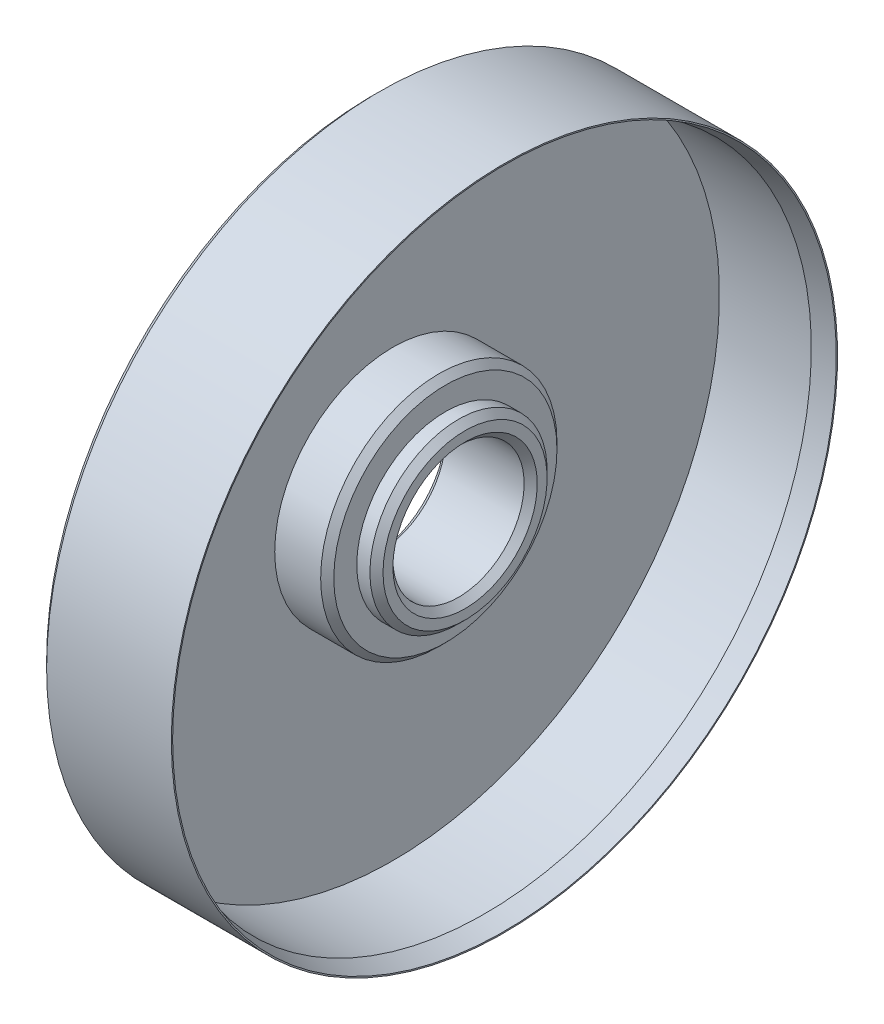
ISO-10303-21;
HEADER;
FILE_DESCRIPTION(('STEP AP214'),'2;1');
FILE_NAME('part.step','',(''),(''),'','','');
FILE_SCHEMA(('AUTOMOTIVE_DESIGN { 1 0 10303 214 1 1 1 1 }'));
ENDSEC;
DATA;
#1=APPLICATION_CONTEXT('core data for automotive mechanical design processes');
#2=APPLICATION_PROTOCOL_DEFINITION('international standard','automotive_design',2000,#1);
#3=PRODUCT_CONTEXT('',#1,'mechanical');
#4=PRODUCT('Part','Part','',(#3));
#5=PRODUCT_RELATED_PRODUCT_CATEGORY('part','',(#4));
#6=PRODUCT_DEFINITION_FORMATION('','',#4);
#7=PRODUCT_DEFINITION_CONTEXT('part definition',#1,'design');
#8=PRODUCT_DEFINITION('design','',#6,#7);
#9=PRODUCT_DEFINITION_SHAPE('','',#8);
#10=(LENGTH_UNIT() NAMED_UNIT(*) SI_UNIT(.MILLI.,.METRE.));
#11=(NAMED_UNIT(*) PLANE_ANGLE_UNIT() SI_UNIT($,.RADIAN.));
#12=(NAMED_UNIT(*) SI_UNIT($,.STERADIAN.) SOLID_ANGLE_UNIT());
#13=UNCERTAINTY_MEASURE_WITH_UNIT(LENGTH_MEASURE(1.E-05),#10,'distance_accuracy_value','');
#14=(GEOMETRIC_REPRESENTATION_CONTEXT(3) GLOBAL_UNCERTAINTY_ASSIGNED_CONTEXT((#13)) GLOBAL_UNIT_ASSIGNED_CONTEXT((#10,
#11,#12)) REPRESENTATION_CONTEXT('',''));
#15=CARTESIAN_POINT('',(0.,0.,0.));
#16=DIRECTION('',(0.,0.,1.));
#17=DIRECTION('',(1.,0.,0.));
#18=AXIS2_PLACEMENT_3D('',#15,#16,#17);
#19=CARTESIAN_POINT('',(0.,0.,0.));
#20=DIRECTION('',(-1.,0.,0.));
#21=DIRECTION('',(0.,0.,1.));
#22=AXIS2_PLACEMENT_3D('',#19,#20,#21);
#23=CYLINDRICAL_SURFACE('',#22,18.);
#24=CARTESIAN_POINT('',(3.,0.,0.));
#25=DIRECTION('',(-1.,0.,0.));
#26=DIRECTION('',(0.,0.,1.));
#27=AXIS2_PLACEMENT_3D('',#24,#25,#26);
#28=CIRCLE('',#27,18.);
#29=CARTESIAN_POINT('',(3.,0.,18.));
#30=VERTEX_POINT('',#29);
#31=EDGE_CURVE('E110',#30,#30,#28,.T.);
#32=ORIENTED_EDGE('',*,*,#31,.F.);
#33=EDGE_LOOP('',(#32));
#34=FACE_BOUND('',#33,.T.);
#35=CARTESIAN_POINT('',(10.,0.,0.));
#36=DIRECTION('',(-1.,0.,0.));
#37=DIRECTION('',(0.,0.,1.));
#38=AXIS2_PLACEMENT_3D('',#35,#36,#37);
#39=CIRCLE('',#38,18.);
#40=CARTESIAN_POINT('',(10.,0.,18.));
#41=VERTEX_POINT('',#40);
#42=EDGE_CURVE('E10',#41,#41,#39,.T.);
#43=ORIENTED_EDGE('',*,*,#42,.T.);
#44=EDGE_LOOP('',(#43));
#45=FACE_BOUND('',#44,.T.);
#46=ADVANCED_FACE('F43',(#34,#45),#23,.T.);
#47=CARTESIAN_POINT('',(11.,0.,0.));
#48=DIRECTION('',(-1.,0.,0.));
#49=DIRECTION('',(0.,0.,1.));
#50=AXIS2_PLACEMENT_3D('',#47,#48,#49);
#51=CONICAL_SURFACE('',#50,17.,0.785398163397449);
#52=ORIENTED_EDGE('',*,*,#42,.F.);
#53=EDGE_LOOP('',(#52));
#54=FACE_BOUND('',#53,.T.);
#55=CARTESIAN_POINT('',(11.,0.,0.));
#56=DIRECTION('',(-1.,0.,0.));
#57=DIRECTION('',(0.,0.,1.));
#58=AXIS2_PLACEMENT_3D('',#55,#56,#57);
#59=CIRCLE('',#58,17.);
#60=CARTESIAN_POINT('',(11.,0.,17.));
#61=VERTEX_POINT('',#60);
#62=EDGE_CURVE('E50',#61,#61,#59,.T.);
#63=ORIENTED_EDGE('',*,*,#62,.T.);
#64=EDGE_LOOP('',(#63));
#65=FACE_BOUND('',#64,.T.);
#66=ADVANCED_FACE('F118',(#54,#65),#51,.T.);
#67=CARTESIAN_POINT('',(11.,17.,0.));
#68=DIRECTION('',(-1.,0.,0.));
#69=DIRECTION('',(0.,0.,1.));
#70=AXIS2_PLACEMENT_3D('',#67,#68,#69);
#71=PLANE('',#70);
#72=ORIENTED_EDGE('',*,*,#62,.F.);
#73=EDGE_LOOP('',(#72));
#74=FACE_BOUND('',#73,.T.);
#75=CARTESIAN_POINT('',(11.,0.,0.));
#76=DIRECTION('',(-1.,0.,0.));
#77=DIRECTION('',(0.,0.,1.));
#78=AXIS2_PLACEMENT_3D('',#75,#76,#77);
#79=CIRCLE('',#78,13.5);
#80=CARTESIAN_POINT('',(11.,0.,13.5));
#81=VERTEX_POINT('',#80);
#82=EDGE_CURVE('E55',#81,#81,#79,.T.);
#83=ORIENTED_EDGE('',*,*,#82,.T.);
#84=EDGE_LOOP('',(#83));
#85=FACE_BOUND('',#84,.T.);
#86=ADVANCED_FACE('F122',(#74,#85),#71,.F.);
#87=CARTESIAN_POINT('',(0.,0.,0.));
#88=DIRECTION('',(-1.,0.,0.));
#89=DIRECTION('',(0.,0.,1.));
#90=AXIS2_PLACEMENT_3D('',#87,#88,#89);
#91=CYLINDRICAL_SURFACE('',#90,13.5);
#92=ORIENTED_EDGE('',*,*,#82,.F.);
#93=EDGE_LOOP('',(#92));
#94=FACE_BOUND('',#93,.T.);
#95=CARTESIAN_POINT('',(13.,0.,0.));
#96=DIRECTION('',(-1.,0.,0.));
#97=DIRECTION('',(0.,0.,1.));
#98=AXIS2_PLACEMENT_3D('',#95,#96,#97);
#99=CIRCLE('',#98,13.5);
#100=CARTESIAN_POINT('',(13.,0.,13.5));
#101=VERTEX_POINT('',#100);
#102=EDGE_CURVE('E60',#101,#101,#99,.T.);
#103=ORIENTED_EDGE('',*,*,#102,.T.);
#104=EDGE_LOOP('',(#103));
#105=FACE_BOUND('',#104,.T.);
#106=ADVANCED_FACE('F127',(#94,#105),#91,.T.);
#107=CARTESIAN_POINT('',(14.,0.,0.));
#108=DIRECTION('',(-1.,0.,0.));
#109=DIRECTION('',(0.,0.,1.));
#110=AXIS2_PLACEMENT_3D('',#107,#108,#109);
#111=CONICAL_SURFACE('',#110,12.5,0.785398163397448);
#112=ORIENTED_EDGE('',*,*,#102,.F.);
#113=EDGE_LOOP('',(#112));
#114=FACE_BOUND('',#113,.T.);
#115=CARTESIAN_POINT('',(14.,0.,0.));
#116=DIRECTION('',(-1.,0.,0.));
#117=DIRECTION('',(0.,0.,1.));
#118=AXIS2_PLACEMENT_3D('',#115,#116,#117);
#119=CIRCLE('',#118,12.5);
#120=CARTESIAN_POINT('',(14.,0.,12.5));
#121=VERTEX_POINT('',#120);
#122=EDGE_CURVE('E66',#121,#121,#119,.T.);
#123=ORIENTED_EDGE('',*,*,#122,.T.);
#124=EDGE_LOOP('',(#123));
#125=FACE_BOUND('',#124,.T.);
#126=ADVANCED_FACE('F133',(#114,#125),#111,.T.);
#127=CARTESIAN_POINT('',(14.,12.5,0.));
#128=DIRECTION('',(-1.,0.,0.));
#129=DIRECTION('',(0.,0.,1.));
#130=AXIS2_PLACEMENT_3D('',#127,#128,#129);
#131=PLANE('',#130);
#132=ORIENTED_EDGE('',*,*,#122,.F.);
#133=EDGE_LOOP('',(#132));
#134=FACE_BOUND('',#133,.T.);
#135=CARTESIAN_POINT('',(14.,0.,0.));
#136=DIRECTION('',(-1.,0.,0.));
#137=DIRECTION('',(0.,0.,1.));
#138=AXIS2_PLACEMENT_3D('',#135,#136,#137);
#139=CIRCLE('',#138,11.);
#140=CARTESIAN_POINT('',(14.,0.,11.));
#141=VERTEX_POINT('',#140);
#142=EDGE_CURVE('E70',#141,#141,#139,.T.);
#143=ORIENTED_EDGE('',*,*,#142,.T.);
#144=EDGE_LOOP('',(#143));
#145=FACE_BOUND('',#144,.T.);
#146=ADVANCED_FACE('F137',(#134,#145),#131,.F.);
#147=CARTESIAN_POINT('',(13.,0.,0.));
#148=DIRECTION('',(1.,0.,0.));
#149=DIRECTION('',(0.,0.,-1.));
#150=AXIS2_PLACEMENT_3D('',#147,#148,#149);
#151=CONICAL_SURFACE('',#150,10.,0.785398163397449);
#152=ORIENTED_EDGE('',*,*,#142,.F.);
#153=EDGE_LOOP('',(#152));
#154=FACE_BOUND('',#153,.T.);
#155=CARTESIAN_POINT('',(13.,0.,0.));
#156=DIRECTION('',(-1.,0.,0.));
#157=DIRECTION('',(0.,0.,1.));
#158=AXIS2_PLACEMENT_3D('',#155,#156,#157);
#159=CIRCLE('',#158,10.);
#160=CARTESIAN_POINT('',(13.,0.,10.));
#161=VERTEX_POINT('',#160);
#162=EDGE_CURVE('E74',#161,#161,#159,.T.);
#163=ORIENTED_EDGE('',*,*,#162,.T.);
#164=EDGE_LOOP('',(#163));
#165=FACE_BOUND('',#164,.T.);
#166=ADVANCED_FACE('F141',(#154,#165),#151,.F.);
#167=CARTESIAN_POINT('',(0.,0.,0.));
#168=DIRECTION('',(-1.,0.,0.));
#169=DIRECTION('',(0.,0.,1.));
#170=AXIS2_PLACEMENT_3D('',#167,#168,#169);
#171=CYLINDRICAL_SURFACE('',#170,10.);
#172=ORIENTED_EDGE('',*,*,#162,.F.);
#173=EDGE_LOOP('',(#172));
#174=FACE_BOUND('',#173,.T.);
#175=CARTESIAN_POINT('',(1.,0.,0.));
#176=DIRECTION('',(-1.,0.,0.));
#177=DIRECTION('',(0.,0.,1.));
#178=AXIS2_PLACEMENT_3D('',#175,#176,#177);
#179=CIRCLE('',#178,10.);
#180=CARTESIAN_POINT('',(1.,0.,10.));
#181=VERTEX_POINT('',#180);
#182=EDGE_CURVE('E78',#181,#181,#179,.T.);
#183=ORIENTED_EDGE('',*,*,#182,.T.);
#184=EDGE_LOOP('',(#183));
#185=FACE_BOUND('',#184,.T.);
#186=ADVANCED_FACE('F145',(#174,#185),#171,.F.);
#187=CARTESIAN_POINT('',(0.,0.,0.));
#188=DIRECTION('',(-1.,0.,0.));
#189=DIRECTION('',(0.,0.,1.));
#190=AXIS2_PLACEMENT_3D('',#187,#188,#189);
#191=CONICAL_SURFACE('',#190,11.,0.785398163397448);
#192=ORIENTED_EDGE('',*,*,#182,.F.);
#193=EDGE_LOOP('',(#192));
#194=FACE_BOUND('',#193,.T.);
#195=CARTESIAN_POINT('',(0.,0.,0.));
#196=DIRECTION('',(-1.,0.,0.));
#197=DIRECTION('',(0.,0.,1.));
#198=AXIS2_PLACEMENT_3D('',#195,#196,#197);
#199=CIRCLE('',#198,11.);
#200=CARTESIAN_POINT('',(0.,0.,11.));
#201=VERTEX_POINT('',#200);
#202=EDGE_CURVE('E82',#201,#201,#199,.T.);
#203=ORIENTED_EDGE('',*,*,#202,.T.);
#204=EDGE_LOOP('',(#203));
#205=FACE_BOUND('',#204,.T.);
#206=ADVANCED_FACE('F149',(#194,#205),#191,.F.);
#207=CARTESIAN_POINT('',(0.,11.,0.));
#208=DIRECTION('',(1.,0.,0.));
#209=DIRECTION('',(0.,0.,-1.));
#210=AXIS2_PLACEMENT_3D('',#207,#208,#209);
#211=PLANE('',#210);
#212=ORIENTED_EDGE('',*,*,#202,.F.);
#213=EDGE_LOOP('',(#212));
#214=FACE_BOUND('',#213,.T.);
#215=CARTESIAN_POINT('',(0.,0.,0.));
#216=DIRECTION('',(-1.,0.,0.));
#217=DIRECTION('',(0.,0.,1.));
#218=AXIS2_PLACEMENT_3D('',#215,#216,#217);
#219=CIRCLE('',#218,49.75);
#220=CARTESIAN_POINT('',(0.,0.,49.75));
#221=VERTEX_POINT('',#220);
#222=EDGE_CURVE('E86',#221,#221,#219,.T.);
#223=ORIENTED_EDGE('',*,*,#222,.T.);
#224=EDGE_LOOP('',(#223));
#225=FACE_BOUND('',#224,.T.);
#226=ADVANCED_FACE('F153',(#214,#225),#211,.F.);
#227=CARTESIAN_POINT('',(1.,0.,0.));
#228=DIRECTION('',(1.,0.,0.));
#229=DIRECTION('',(0.,0.,-1.));
#230=AXIS2_PLACEMENT_3D('',#227,#228,#229);
#231=CONICAL_SURFACE('',#230,50.75,0.785398163397449);
#232=ORIENTED_EDGE('',*,*,#222,.F.);
#233=EDGE_LOOP('',(#232));
#234=FACE_BOUND('',#233,.T.);
#235=CARTESIAN_POINT('',(1.,0.,0.));
#236=DIRECTION('',(-1.,0.,0.));
#237=DIRECTION('',(0.,0.,1.));
#238=AXIS2_PLACEMENT_3D('',#235,#236,#237);
#239=CIRCLE('',#238,50.75);
#240=CARTESIAN_POINT('',(1.,0.,50.75));
#241=VERTEX_POINT('',#240);
#242=EDGE_CURVE('E90',#241,#241,#239,.T.);
#243=ORIENTED_EDGE('',*,*,#242,.T.);
#244=EDGE_LOOP('',(#243));
#245=FACE_BOUND('',#244,.T.);
#246=ADVANCED_FACE('F157',(#234,#245),#231,.T.);
#247=CARTESIAN_POINT('',(0.,0.,0.));
#248=DIRECTION('',(-1.,0.,0.));
#249=DIRECTION('',(0.,0.,1.));
#250=AXIS2_PLACEMENT_3D('',#247,#248,#249);
#251=CYLINDRICAL_SURFACE('',#250,50.75);
#252=ORIENTED_EDGE('',*,*,#242,.F.);
#253=EDGE_LOOP('',(#252));
#254=FACE_BOUND('',#253,.T.);
#255=CARTESIAN_POINT('',(20.,0.,0.));
#256=DIRECTION('',(-1.,0.,0.));
#257=DIRECTION('',(0.,0.,1.));
#258=AXIS2_PLACEMENT_3D('',#255,#256,#257);
#259=CIRCLE('',#258,50.75);
#260=CARTESIAN_POINT('',(20.,0.,50.75));
#261=VERTEX_POINT('',#260);
#262=EDGE_CURVE('E94',#261,#261,#259,.T.);
#263=ORIENTED_EDGE('',*,*,#262,.T.);
#264=EDGE_LOOP('',(#263));
#265=FACE_BOUND('',#264,.T.);
#266=ADVANCED_FACE('F161',(#254,#265),#251,.T.);
#267=CARTESIAN_POINT('',(20.,50.75,0.));
#268=DIRECTION('',(-1.,0.,0.));
#269=DIRECTION('',(0.,0.,1.));
#270=AXIS2_PLACEMENT_3D('',#267,#268,#269);
#271=PLANE('',#270);
#272=ORIENTED_EDGE('',*,*,#262,.F.);
#273=EDGE_LOOP('',(#272));
#274=FACE_BOUND('',#273,.T.);
#275=CARTESIAN_POINT('',(20.,0.,0.));
#276=DIRECTION('',(-1.,0.,0.));
#277=DIRECTION('',(0.,0.,1.));
#278=AXIS2_PLACEMENT_3D('',#275,#276,#277);
#279=CIRCLE('',#278,50.5538475772934);
#280=CARTESIAN_POINT('',(20.,0.,50.5538475772934));
#281=VERTEX_POINT('',#280);
#282=EDGE_CURVE('E98',#281,#281,#279,.T.);
#283=ORIENTED_EDGE('',*,*,#282,.T.);
#284=EDGE_LOOP('',(#283));
#285=FACE_BOUND('',#284,.T.);
#286=ADVANCED_FACE('F165',(#274,#285),#271,.F.);
#287=CARTESIAN_POINT('',(17.,0.,0.));
#288=DIRECTION('',(1.,0.,0.));
#289=DIRECTION('',(0.,0.,-1.));
#290=AXIS2_PLACEMENT_3D('',#287,#288,#289);
#291=CONICAL_SURFACE('',#290,49.75,0.261799387799143);
#292=ORIENTED_EDGE('',*,*,#282,.F.);
#293=EDGE_LOOP('',(#292));
#294=FACE_BOUND('',#293,.T.);
#295=CARTESIAN_POINT('',(17.,0.,0.));
#296=DIRECTION('',(-1.,0.,0.));
#297=DIRECTION('',(0.,0.,1.));
#298=AXIS2_PLACEMENT_3D('',#295,#296,#297);
#299=CIRCLE('',#298,49.75);
#300=CARTESIAN_POINT('',(17.,0.,49.75));
#301=VERTEX_POINT('',#300);
#302=EDGE_CURVE('E102',#301,#301,#299,.T.);
#303=ORIENTED_EDGE('',*,*,#302,.T.);
#304=EDGE_LOOP('',(#303));
#305=FACE_BOUND('',#304,.T.);
#306=ADVANCED_FACE('F169',(#294,#305),#291,.F.);
#307=CARTESIAN_POINT('',(0.,0.,0.));
#308=DIRECTION('',(-1.,0.,0.));
#309=DIRECTION('',(0.,0.,1.));
#310=AXIS2_PLACEMENT_3D('',#307,#308,#309);
#311=CYLINDRICAL_SURFACE('',#310,49.75);
#312=ORIENTED_EDGE('',*,*,#302,.F.);
#313=EDGE_LOOP('',(#312));
#314=FACE_BOUND('',#313,.T.);
#315=CARTESIAN_POINT('',(3.,0.,0.));
#316=DIRECTION('',(-1.,0.,0.));
#317=DIRECTION('',(0.,0.,1.));
#318=AXIS2_PLACEMENT_3D('',#315,#316,#317);
#319=CIRCLE('',#318,49.75);
#320=CARTESIAN_POINT('',(3.,0.,49.75));
#321=VERTEX_POINT('',#320);
#322=EDGE_CURVE('E106',#321,#321,#319,.T.);
#323=ORIENTED_EDGE('',*,*,#322,.T.);
#324=EDGE_LOOP('',(#323));
#325=FACE_BOUND('',#324,.T.);
#326=ADVANCED_FACE('F173',(#314,#325),#311,.F.);
#327=CARTESIAN_POINT('',(3.,49.75,0.));
#328=DIRECTION('',(-1.,0.,0.));
#329=DIRECTION('',(0.,0.,1.));
#330=AXIS2_PLACEMENT_3D('',#327,#328,#329);
#331=PLANE('',#330);
#332=ORIENTED_EDGE('',*,*,#322,.F.);
#333=EDGE_LOOP('',(#332));
#334=FACE_BOUND('',#333,.T.);
#335=ORIENTED_EDGE('',*,*,#31,.T.);
#336=EDGE_LOOP('',(#335));
#337=FACE_BOUND('',#336,.T.);
#338=ADVANCED_FACE('F115',(#334,#337),#331,.F.);
#339=CLOSED_SHELL('',(#46,#66,#86,#106,#126,#146,#166,#186,#206,#226,#246,#266,#286,#306,#326,#338));
#340=MANIFOLD_SOLID_BREP('B2',#339);
#341=ADVANCED_BREP_SHAPE_REPRESENTATION('',(#18,#340),#14);
#342=SHAPE_DEFINITION_REPRESENTATION(#9,#341);
ENDSEC;
END-ISO-10303-21;
